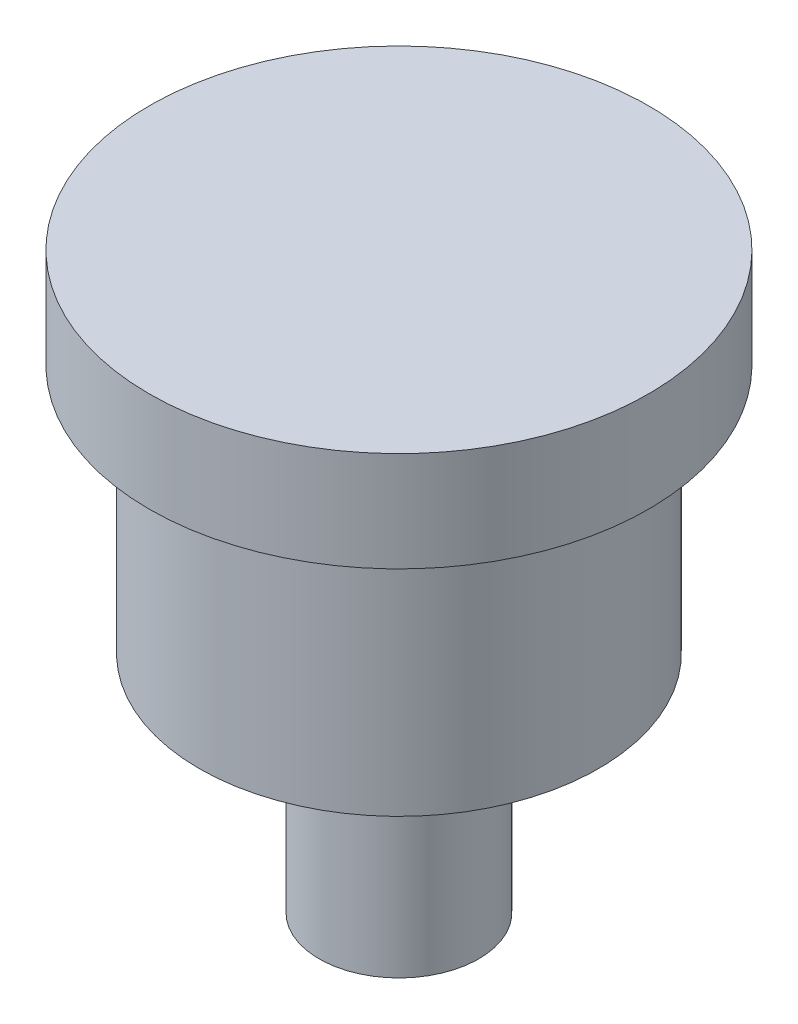
ISO-10303-21;
HEADER;
FILE_DESCRIPTION(('STEP AP214'),'2;1');
FILE_NAME('part.step','',(''),(''),'','','');
FILE_SCHEMA(('AUTOMOTIVE_DESIGN { 1 0 10303 214 1 1 1 1 }'));
ENDSEC;
DATA;
#1=APPLICATION_CONTEXT('core data for automotive mechanical design processes');
#2=APPLICATION_PROTOCOL_DEFINITION('international standard','automotive_design',2000,#1);
#3=PRODUCT_CONTEXT('',#1,'mechanical');
#4=PRODUCT('Part','Part','',(#3));
#5=PRODUCT_RELATED_PRODUCT_CATEGORY('part','',(#4));
#6=PRODUCT_DEFINITION_FORMATION('','',#4);
#7=PRODUCT_DEFINITION_CONTEXT('part definition',#1,'design');
#8=PRODUCT_DEFINITION('design','',#6,#7);
#9=PRODUCT_DEFINITION_SHAPE('','',#8);
#10=(LENGTH_UNIT() NAMED_UNIT(*) SI_UNIT(.MILLI.,.METRE.));
#11=(NAMED_UNIT(*) PLANE_ANGLE_UNIT() SI_UNIT($,.RADIAN.));
#12=(NAMED_UNIT(*) SI_UNIT($,.STERADIAN.) SOLID_ANGLE_UNIT());
#13=UNCERTAINTY_MEASURE_WITH_UNIT(LENGTH_MEASURE(1.E-05),#10,'distance_accuracy_value','');
#14=(GEOMETRIC_REPRESENTATION_CONTEXT(3) GLOBAL_UNCERTAINTY_ASSIGNED_CONTEXT((#13)) GLOBAL_UNIT_ASSIGNED_CONTEXT((#10,
#11,#12)) REPRESENTATION_CONTEXT('',''));
#15=CARTESIAN_POINT('',(0.,0.,0.));
#16=DIRECTION('',(0.,0.,1.));
#17=DIRECTION('',(1.,0.,0.));
#18=AXIS2_PLACEMENT_3D('',#15,#16,#17);
#19=CARTESIAN_POINT('',(0.,2.,0.));
#20=DIRECTION('',(0.,-1.,0.));
#21=DIRECTION('',(0.,0.,-1.));
#22=AXIS2_PLACEMENT_3D('',#19,#20,#21);
#23=CYLINDRICAL_SURFACE('',#22,5.);
#24=CARTESIAN_POINT('',(0.,2.,0.));
#25=DIRECTION('',(0.,1.,0.));
#26=DIRECTION('',(0.,0.,1.));
#27=AXIS2_PLACEMENT_3D('',#24,#25,#26);
#28=CIRCLE('',#27,5.);
#29=CARTESIAN_POINT('',(0.,2.,5.));
#30=VERTEX_POINT('',#29);
#31=EDGE_CURVE('E51',#30,#30,#28,.T.);
#32=ORIENTED_EDGE('',*,*,#31,.F.);
#33=EDGE_LOOP('',(#32));
#34=FACE_BOUND('',#33,.T.);
#35=CARTESIAN_POINT('',(0.,0.,0.));
#36=DIRECTION('',(0.,1.,0.));
#37=DIRECTION('',(0.,0.,1.));
#38=AXIS2_PLACEMENT_3D('',#35,#36,#37);
#39=CIRCLE('',#38,5.);
#40=CARTESIAN_POINT('',(0.,0.,5.));
#41=VERTEX_POINT('',#40);
#42=EDGE_CURVE('E40',#41,#41,#39,.T.);
#43=ORIENTED_EDGE('',*,*,#42,.T.);
#44=EDGE_LOOP('',(#43));
#45=FACE_BOUND('',#44,.T.);
#46=ADVANCED_FACE('F37',(#34,#45),#23,.T.);
#47=CARTESIAN_POINT('',(0.,2.,0.));
#48=DIRECTION('',(0.,1.,0.));
#49=DIRECTION('',(0.,0.,1.));
#50=AXIS2_PLACEMENT_3D('',#47,#48,#49);
#51=PLANE('',#50);
#52=ORIENTED_EDGE('',*,*,#31,.T.);
#53=EDGE_LOOP('',(#52));
#54=FACE_BOUND('',#53,.T.);
#55=ADVANCED_FACE('F71',(#54),#51,.T.);
#56=CARTESIAN_POINT('',(0.,0.,0.));
#57=DIRECTION('',(0.,1.,0.));
#58=DIRECTION('',(0.,0.,1.));
#59=AXIS2_PLACEMENT_3D('',#56,#57,#58);
#60=PLANE('',#59);
#61=CARTESIAN_POINT('',(0.,0.,0.));
#62=DIRECTION('',(0.,-1.,0.));
#63=DIRECTION('',(0.,0.,-1.));
#64=AXIS2_PLACEMENT_3D('',#61,#62,#63);
#65=CIRCLE('',#64,4.);
#66=CARTESIAN_POINT('',(0.,0.,-4.));
#67=VERTEX_POINT('',#66);
#68=EDGE_CURVE('E45',#67,#67,#65,.T.);
#69=ORIENTED_EDGE('',*,*,#68,.F.);
#70=EDGE_LOOP('',(#69));
#71=FACE_BOUND('',#70,.T.);
#72=ORIENTED_EDGE('',*,*,#42,.F.);
#73=EDGE_LOOP('',(#72));
#74=FACE_BOUND('',#73,.T.);
#75=ADVANCED_FACE('F68',(#71,#74),#60,.F.);
#76=CARTESIAN_POINT('',(0.,-5.,0.));
#77=DIRECTION('',(0.,1.,0.));
#78=DIRECTION('',(0.,0.,1.));
#79=AXIS2_PLACEMENT_3D('',#76,#77,#78);
#80=CYLINDRICAL_SURFACE('',#79,4.);
#81=CARTESIAN_POINT('',(0.,-5.,0.));
#82=DIRECTION('',(0.,-1.,0.));
#83=DIRECTION('',(0.,0.,-1.));
#84=AXIS2_PLACEMENT_3D('',#81,#82,#83);
#85=CIRCLE('',#84,4.);
#86=CARTESIAN_POINT('',(0.,-5.,-4.));
#87=VERTEX_POINT('',#86);
#88=EDGE_CURVE('E56',#87,#87,#85,.T.);
#89=ORIENTED_EDGE('',*,*,#88,.F.);
#90=EDGE_LOOP('',(#89));
#91=FACE_BOUND('',#90,.T.);
#92=ORIENTED_EDGE('',*,*,#68,.T.);
#93=EDGE_LOOP('',(#92));
#94=FACE_BOUND('',#93,.T.);
#95=ADVANCED_FACE('F70',(#91,#94),#80,.T.);
#96=CARTESIAN_POINT('',(0.,-5.,0.));
#97=DIRECTION('',(0.,-1.,0.));
#98=DIRECTION('',(0.,0.,-1.));
#99=AXIS2_PLACEMENT_3D('',#96,#97,#98);
#100=PLANE('',#99);
#101=CARTESIAN_POINT('',(0.,-5.,0.));
#102=DIRECTION('',(0.,-1.,0.));
#103=DIRECTION('',(0.,0.,-1.));
#104=AXIS2_PLACEMENT_3D('',#101,#102,#103);
#105=CIRCLE('',#104,1.6);
#106=CARTESIAN_POINT('',(0.,-5.,-1.6));
#107=VERTEX_POINT('',#106);
#108=EDGE_CURVE('E10',#107,#107,#105,.T.);
#109=ORIENTED_EDGE('',*,*,#108,.F.);
#110=EDGE_LOOP('',(#109));
#111=FACE_BOUND('',#110,.T.);
#112=ORIENTED_EDGE('',*,*,#88,.T.);
#113=EDGE_LOOP('',(#112));
#114=FACE_BOUND('',#113,.T.);
#115=ADVANCED_FACE('F77',(#111,#114),#100,.T.);
#116=CARTESIAN_POINT('',(0.,-9.5,0.));
#117=DIRECTION('',(0.,1.,0.));
#118=DIRECTION('',(0.,0.,1.));
#119=AXIS2_PLACEMENT_3D('',#116,#117,#118);
#120=CYLINDRICAL_SURFACE('',#119,1.6);
#121=CARTESIAN_POINT('',(0.,-9.5,0.));
#122=DIRECTION('',(0.,-1.,0.));
#123=DIRECTION('',(0.,0.,-1.));
#124=AXIS2_PLACEMENT_3D('',#121,#122,#123);
#125=CIRCLE('',#124,1.6);
#126=CARTESIAN_POINT('',(0.,-9.5,-1.6));
#127=VERTEX_POINT('',#126);
#128=EDGE_CURVE('E55',#127,#127,#125,.T.);
#129=ORIENTED_EDGE('',*,*,#128,.F.);
#130=EDGE_LOOP('',(#129));
#131=FACE_BOUND('',#130,.T.);
#132=ORIENTED_EDGE('',*,*,#108,.T.);
#133=EDGE_LOOP('',(#132));
#134=FACE_BOUND('',#133,.T.);
#135=ADVANCED_FACE('F109',(#131,#134),#120,.T.);
#136=CARTESIAN_POINT('',(0.,-9.5,0.));
#137=DIRECTION('',(0.,-1.,0.));
#138=DIRECTION('',(0.,0.,-1.));
#139=AXIS2_PLACEMENT_3D('',#136,#137,#138);
#140=PLANE('',#139);
#141=ORIENTED_EDGE('',*,*,#128,.T.);
#142=EDGE_LOOP('',(#141));
#143=FACE_BOUND('',#142,.T.);
#144=ADVANCED_FACE('F119',(#143),#140,.T.);
#145=CLOSED_SHELL('',(#46,#55,#75,#95,#115,#135,#144));
#146=MANIFOLD_SOLID_BREP('B2',#145);
#147=ADVANCED_BREP_SHAPE_REPRESENTATION('',(#18,#146),#14);
#148=SHAPE_DEFINITION_REPRESENTATION(#9,#147);
ENDSEC;
END-ISO-10303-21;
